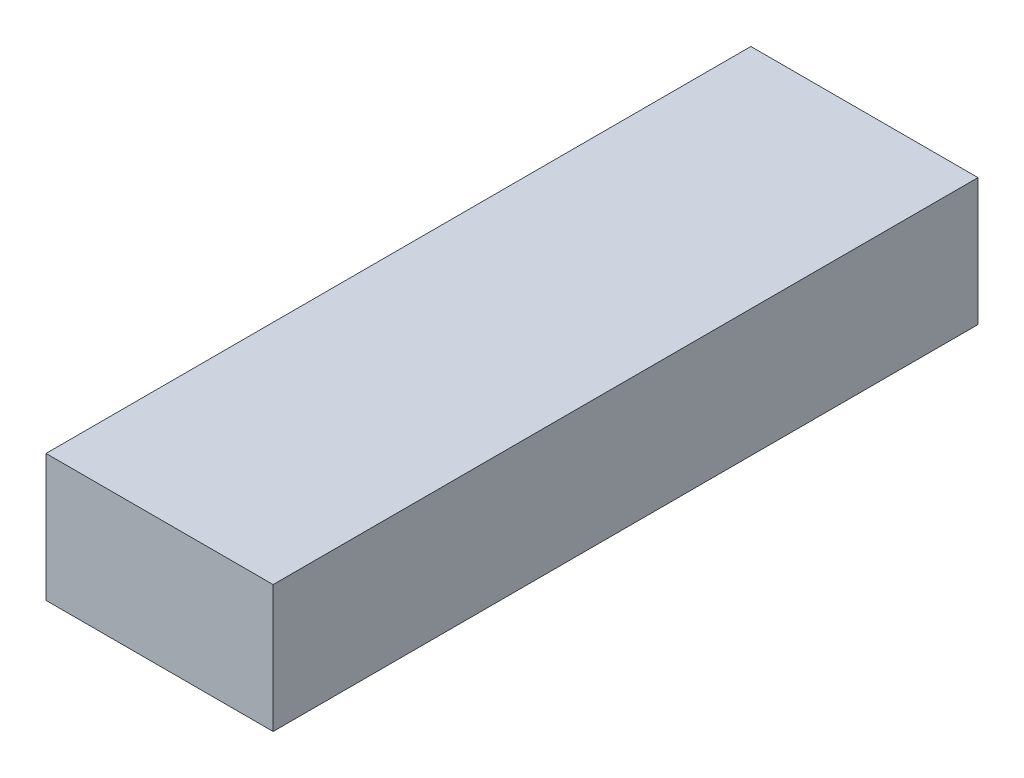
ISO-10303-21;
HEADER;
FILE_DESCRIPTION(('STEP AP214'),'2;1');
FILE_NAME('part.step','',(''),(''),'','','');
FILE_SCHEMA(('AUTOMOTIVE_DESIGN { 1 0 10303 214 1 1 1 1 }'));
ENDSEC;
DATA;
#1=APPLICATION_CONTEXT('core data for automotive mechanical design processes');
#2=APPLICATION_PROTOCOL_DEFINITION('international standard','automotive_design',2000,#1);
#3=PRODUCT_CONTEXT('',#1,'mechanical');
#4=PRODUCT('Part','Part','',(#3));
#5=PRODUCT_RELATED_PRODUCT_CATEGORY('part','',(#4));
#6=PRODUCT_DEFINITION_FORMATION('','',#4);
#7=PRODUCT_DEFINITION_CONTEXT('part definition',#1,'design');
#8=PRODUCT_DEFINITION('design','',#6,#7);
#9=PRODUCT_DEFINITION_SHAPE('','',#8);
#10=(LENGTH_UNIT() NAMED_UNIT(*) SI_UNIT(.MILLI.,.METRE.));
#11=(NAMED_UNIT(*) PLANE_ANGLE_UNIT() SI_UNIT($,.RADIAN.));
#12=(NAMED_UNIT(*) SI_UNIT($,.STERADIAN.) SOLID_ANGLE_UNIT());
#13=UNCERTAINTY_MEASURE_WITH_UNIT(LENGTH_MEASURE(1.E-05),#10,'distance_accuracy_value','');
#14=(GEOMETRIC_REPRESENTATION_CONTEXT(3) GLOBAL_UNCERTAINTY_ASSIGNED_CONTEXT((#13)) GLOBAL_UNIT_ASSIGNED_CONTEXT((#10,
#11,#12)) REPRESENTATION_CONTEXT('',''));
#15=CARTESIAN_POINT('',(0.,0.,0.));
#16=DIRECTION('',(0.,0.,1.));
#17=DIRECTION('',(1.,0.,0.));
#18=AXIS2_PLACEMENT_3D('',#15,#16,#17);
#19=CARTESIAN_POINT('',(-17.4,19.5,54.));
#20=DIRECTION('',(1.,0.,0.));
#21=DIRECTION('',(0.,0.,-1.));
#22=AXIS2_PLACEMENT_3D('',#19,#20,#21);
#23=PLANE('',#22);
#24=DIRECTION('',(0.,0.,1.));
#25=VECTOR('',#24,1.);
#26=CARTESIAN_POINT('',(-17.4,0.,54.));
#27=LINE('',#26,#25);
#28=CARTESIAN_POINT('',(-17.4,0.,-54.));
#29=VERTEX_POINT('',#28);
#30=CARTESIAN_POINT('',(-17.4,0.,54.));
#31=VERTEX_POINT('',#30);
#32=EDGE_CURVE('E98',#29,#31,#27,.T.);
#33=ORIENTED_EDGE('',*,*,#32,.T.);
#34=DIRECTION('',(0.,-1.,0.));
#35=VECTOR('',#34,1.);
#36=CARTESIAN_POINT('',(-17.4,19.5,54.));
#37=LINE('',#36,#35);
#38=CARTESIAN_POINT('',(-17.4,19.5,54.));
#39=VERTEX_POINT('',#38);
#40=EDGE_CURVE('E11',#39,#31,#37,.T.);
#41=ORIENTED_EDGE('',*,*,#40,.F.);
#42=DIRECTION('',(0.,0.,1.));
#43=VECTOR('',#42,1.);
#44=CARTESIAN_POINT('',(-17.4,19.5,54.));
#45=LINE('',#44,#43);
#46=CARTESIAN_POINT('',(-17.4,19.5,-54.));
#47=VERTEX_POINT('',#46);
#48=EDGE_CURVE('E86',#47,#39,#45,.T.);
#49=ORIENTED_EDGE('',*,*,#48,.F.);
#50=DIRECTION('',(0.,-1.,0.));
#51=VECTOR('',#50,1.);
#52=CARTESIAN_POINT('',(-17.4,19.5,-54.));
#53=LINE('',#52,#51);
#54=EDGE_CURVE('E94',#47,#29,#53,.T.);
#55=ORIENTED_EDGE('',*,*,#54,.T.);
#56=EDGE_LOOP('',(#33,#41,#49,#55));
#57=FACE_BOUND('',#56,.T.);
#58=ADVANCED_FACE('F35',(#57),#23,.F.);
#59=CARTESIAN_POINT('',(-17.4,19.5,54.));
#60=DIRECTION('',(0.,0.,-1.));
#61=DIRECTION('',(-1.,0.,0.));
#62=AXIS2_PLACEMENT_3D('',#59,#60,#61);
#63=PLANE('',#62);
#64=DIRECTION('',(1.,0.,0.));
#65=VECTOR('',#64,1.);
#66=CARTESIAN_POINT('',(-17.4,0.,54.));
#67=LINE('',#66,#65);
#68=CARTESIAN_POINT('',(17.4,0.,54.));
#69=VERTEX_POINT('',#68);
#70=EDGE_CURVE('E90',#31,#69,#67,.T.);
#71=ORIENTED_EDGE('',*,*,#70,.T.);
#72=DIRECTION('',(0.,-1.,0.));
#73=VECTOR('',#72,1.);
#74=CARTESIAN_POINT('',(17.4,19.5,54.));
#75=LINE('',#74,#73);
#76=CARTESIAN_POINT('',(17.4,19.5,54.));
#77=VERTEX_POINT('',#76);
#78=EDGE_CURVE('E43',#77,#69,#75,.T.);
#79=ORIENTED_EDGE('',*,*,#78,.F.);
#80=DIRECTION('',(1.,0.,0.));
#81=VECTOR('',#80,1.);
#82=CARTESIAN_POINT('',(-17.4,19.5,54.));
#83=LINE('',#82,#81);
#84=EDGE_CURVE('E81',#39,#77,#83,.T.);
#85=ORIENTED_EDGE('',*,*,#84,.F.);
#86=ORIENTED_EDGE('',*,*,#40,.T.);
#87=EDGE_LOOP('',(#71,#79,#85,#86));
#88=FACE_BOUND('',#87,.T.);
#89=ADVANCED_FACE('F89',(#88),#63,.F.);
#90=CARTESIAN_POINT('',(17.4,19.5,54.));
#91=DIRECTION('',(-1.,0.,0.));
#92=DIRECTION('',(0.,0.,1.));
#93=AXIS2_PLACEMENT_3D('',#90,#91,#92);
#94=PLANE('',#93);
#95=DIRECTION('',(0.,0.,-1.));
#96=VECTOR('',#95,1.);
#97=CARTESIAN_POINT('',(17.4,0.,54.));
#98=LINE('',#97,#96);
#99=CARTESIAN_POINT('',(17.4,0.,-54.));
#100=VERTEX_POINT('',#99);
#101=EDGE_CURVE('E68',#69,#100,#98,.T.);
#102=ORIENTED_EDGE('',*,*,#101,.T.);
#103=DIRECTION('',(0.,-1.,0.));
#104=VECTOR('',#103,1.);
#105=CARTESIAN_POINT('',(17.4,19.5,-54.));
#106=LINE('',#105,#104);
#107=CARTESIAN_POINT('',(17.4,19.5,-54.));
#108=VERTEX_POINT('',#107);
#109=EDGE_CURVE('E91',#108,#100,#106,.T.);
#110=ORIENTED_EDGE('',*,*,#109,.F.);
#111=DIRECTION('',(0.,0.,-1.));
#112=VECTOR('',#111,1.);
#113=CARTESIAN_POINT('',(17.4,19.5,54.));
#114=LINE('',#113,#112);
#115=EDGE_CURVE('E84',#77,#108,#114,.T.);
#116=ORIENTED_EDGE('',*,*,#115,.F.);
#117=ORIENTED_EDGE('',*,*,#78,.T.);
#118=EDGE_LOOP('',(#102,#110,#116,#117));
#119=FACE_BOUND('',#118,.T.);
#120=ADVANCED_FACE('F92',(#119),#94,.F.);
#121=CARTESIAN_POINT('',(-17.4,19.5,-54.));
#122=DIRECTION('',(0.,0.,1.));
#123=DIRECTION('',(1.,0.,0.));
#124=AXIS2_PLACEMENT_3D('',#121,#122,#123);
#125=PLANE('',#124);
#126=DIRECTION('',(-1.,0.,0.));
#127=VECTOR('',#126,1.);
#128=CARTESIAN_POINT('',(-17.4,0.,-54.));
#129=LINE('',#128,#127);
#130=EDGE_CURVE('E74',#100,#29,#129,.T.);
#131=ORIENTED_EDGE('',*,*,#130,.T.);
#132=ORIENTED_EDGE('',*,*,#54,.F.);
#133=DIRECTION('',(-1.,0.,0.));
#134=VECTOR('',#133,1.);
#135=CARTESIAN_POINT('',(-17.4,19.5,-54.));
#136=LINE('',#135,#134);
#137=EDGE_CURVE('E51',#108,#47,#136,.T.);
#138=ORIENTED_EDGE('',*,*,#137,.F.);
#139=ORIENTED_EDGE('',*,*,#109,.T.);
#140=EDGE_LOOP('',(#131,#132,#138,#139));
#141=FACE_BOUND('',#140,.T.);
#142=ADVANCED_FACE('F105',(#141),#125,.F.);
#143=CARTESIAN_POINT('',(0.,19.5,0.));
#144=DIRECTION('',(0.,-1.,0.));
#145=DIRECTION('',(0.,0.,-1.));
#146=AXIS2_PLACEMENT_3D('',#143,#144,#145);
#147=PLANE('',#146);
#148=ORIENTED_EDGE('',*,*,#48,.T.);
#149=ORIENTED_EDGE('',*,*,#84,.T.);
#150=ORIENTED_EDGE('',*,*,#115,.T.);
#151=ORIENTED_EDGE('',*,*,#137,.T.);
#152=EDGE_LOOP('',(#148,#149,#150,#151));
#153=FACE_BOUND('',#152,.T.);
#154=ADVANCED_FACE('F82',(#153),#147,.F.);
#155=CARTESIAN_POINT('',(0.,0.,0.));
#156=DIRECTION('',(0.,-1.,0.));
#157=DIRECTION('',(0.,0.,-1.));
#158=AXIS2_PLACEMENT_3D('',#155,#156,#157);
#159=PLANE('',#158);
#160=ORIENTED_EDGE('',*,*,#32,.F.);
#161=ORIENTED_EDGE('',*,*,#130,.F.);
#162=ORIENTED_EDGE('',*,*,#101,.F.);
#163=ORIENTED_EDGE('',*,*,#70,.F.);
#164=EDGE_LOOP('',(#160,#161,#162,#163));
#165=FACE_BOUND('',#164,.T.);
#166=ADVANCED_FACE('F108',(#165),#159,.T.);
#167=CLOSED_SHELL('',(#58,#89,#120,#142,#154,#166));
#168=MANIFOLD_SOLID_BREP('B2',#167);
#169=ADVANCED_BREP_SHAPE_REPRESENTATION('',(#18,#168),#14);
#170=SHAPE_DEFINITION_REPRESENTATION(#9,#169);
ENDSEC;
END-ISO-10303-21;
